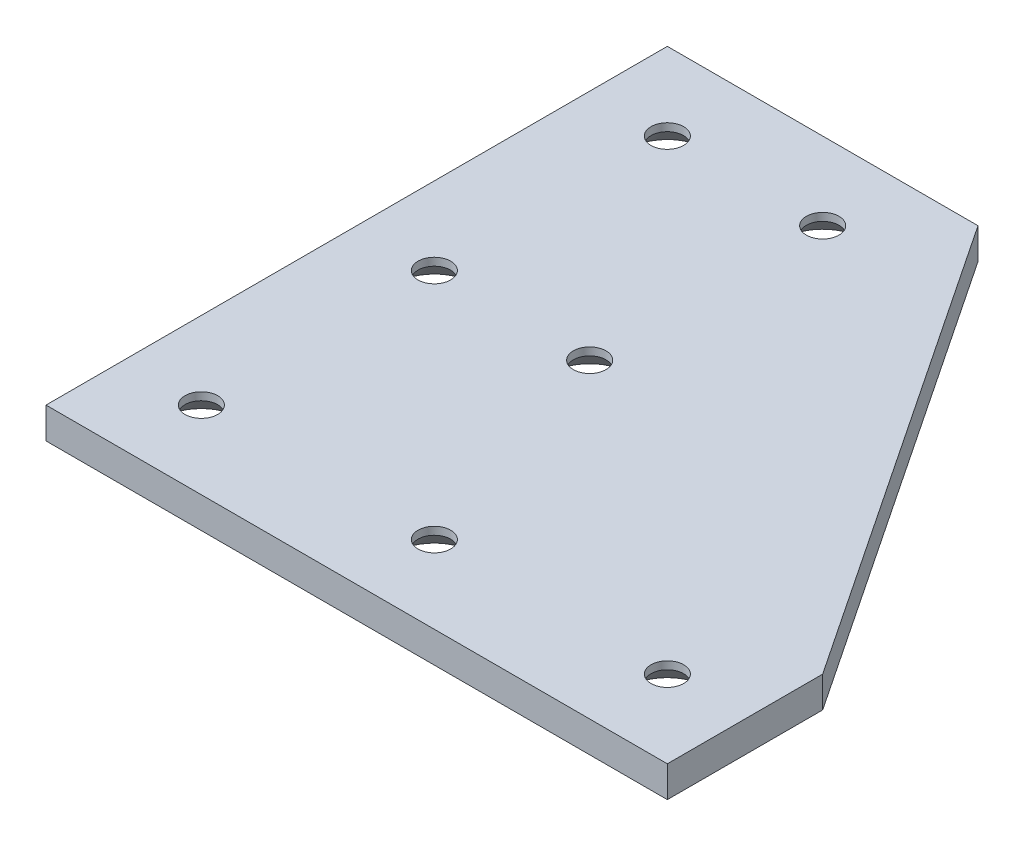
ISO-10303-21;
HEADER;
FILE_DESCRIPTION(('STEP AP214'),'2;1');
FILE_NAME('part.step','',(''),(''),'','','');
FILE_SCHEMA(('AUTOMOTIVE_DESIGN { 1 0 10303 214 1 1 1 1 }'));
ENDSEC;
DATA;
#1=APPLICATION_CONTEXT('core data for automotive mechanical design processes');
#2=APPLICATION_PROTOCOL_DEFINITION('international standard','automotive_design',2000,#1);
#3=PRODUCT_CONTEXT('',#1,'mechanical');
#4=PRODUCT('Part','Part','',(#3));
#5=PRODUCT_RELATED_PRODUCT_CATEGORY('part','',(#4));
#6=PRODUCT_DEFINITION_FORMATION('','',#4);
#7=PRODUCT_DEFINITION_CONTEXT('part definition',#1,'design');
#8=PRODUCT_DEFINITION('design','',#6,#7);
#9=PRODUCT_DEFINITION_SHAPE('','',#8);
#10=(LENGTH_UNIT() NAMED_UNIT(*) SI_UNIT(.MILLI.,.METRE.));
#11=(NAMED_UNIT(*) PLANE_ANGLE_UNIT() SI_UNIT($,.RADIAN.));
#12=(NAMED_UNIT(*) SI_UNIT($,.STERADIAN.) SOLID_ANGLE_UNIT());
#13=UNCERTAINTY_MEASURE_WITH_UNIT(LENGTH_MEASURE(1.E-05),#10,'distance_accuracy_value','');
#14=(GEOMETRIC_REPRESENTATION_CONTEXT(3) GLOBAL_UNCERTAINTY_ASSIGNED_CONTEXT((#13)) GLOBAL_UNIT_ASSIGNED_CONTEXT((#10,
#11,#12)) REPRESENTATION_CONTEXT('',''));
#15=CARTESIAN_POINT('',(0.,0.,0.));
#16=DIRECTION('',(0.,0.,1.));
#17=DIRECTION('',(1.,0.,0.));
#18=AXIS2_PLACEMENT_3D('',#15,#16,#17);
#19=CARTESIAN_POINT('',(0.,4.,-80.));
#20=DIRECTION('',(1.,0.,0.));
#21=DIRECTION('',(0.,0.,-1.));
#22=AXIS2_PLACEMENT_3D('',#19,#20,#21);
#23=PLANE('',#22);
#24=DIRECTION('',(0.,0.,1.));
#25=VECTOR('',#24,1.);
#26=CARTESIAN_POINT('',(0.,0.,-80.));
#27=LINE('',#26,#25);
#28=CARTESIAN_POINT('',(0.,0.,-80.));
#29=VERTEX_POINT('',#28);
#30=CARTESIAN_POINT('',(0.,0.,0.));
#31=VERTEX_POINT('',#30);
#32=EDGE_CURVE('E127',#29,#31,#27,.T.);
#33=ORIENTED_EDGE('',*,*,#32,.T.);
#34=DIRECTION('',(0.,-1.,0.));
#35=VECTOR('',#34,1.);
#36=CARTESIAN_POINT('',(0.,4.,0.));
#37=LINE('',#36,#35);
#38=CARTESIAN_POINT('',(0.,4.,0.));
#39=VERTEX_POINT('',#38);
#40=EDGE_CURVE('E148',#39,#31,#37,.T.);
#41=ORIENTED_EDGE('',*,*,#40,.F.);
#42=DIRECTION('',(0.,0.,1.));
#43=VECTOR('',#42,1.);
#44=CARTESIAN_POINT('',(0.,4.,-80.));
#45=LINE('',#44,#43);
#46=CARTESIAN_POINT('',(0.,4.,-80.));
#47=VERTEX_POINT('',#46);
#48=EDGE_CURVE('E141',#47,#39,#45,.T.);
#49=ORIENTED_EDGE('',*,*,#48,.F.);
#50=DIRECTION('',(0.,-1.,0.));
#51=VECTOR('',#50,1.);
#52=CARTESIAN_POINT('',(0.,4.,-80.));
#53=LINE('',#52,#51);
#54=EDGE_CURVE('E123',#47,#29,#53,.T.);
#55=ORIENTED_EDGE('',*,*,#54,.T.);
#56=EDGE_LOOP('',(#33,#41,#49,#55));
#57=FACE_BOUND('',#56,.T.);
#58=ADVANCED_FACE('F44',(#57),#23,.F.);
#59=CARTESIAN_POINT('',(0.,4.,0.));
#60=DIRECTION('',(0.,0.,-1.));
#61=DIRECTION('',(-1.,0.,0.));
#62=AXIS2_PLACEMENT_3D('',#59,#60,#61);
#63=PLANE('',#62);
#64=DIRECTION('',(1.,0.,0.));
#65=VECTOR('',#64,1.);
#66=CARTESIAN_POINT('',(0.,0.,0.));
#67=LINE('',#66,#65);
#68=CARTESIAN_POINT('',(80.,0.,0.));
#69=VERTEX_POINT('',#68);
#70=EDGE_CURVE('E131',#31,#69,#67,.T.);
#71=ORIENTED_EDGE('',*,*,#70,.T.);
#72=DIRECTION('',(0.,-1.,0.));
#73=VECTOR('',#72,1.);
#74=CARTESIAN_POINT('',(80.,4.,0.));
#75=LINE('',#74,#73);
#76=CARTESIAN_POINT('',(80.,4.,0.));
#77=VERTEX_POINT('',#76);
#78=EDGE_CURVE('E116',#77,#69,#75,.T.);
#79=ORIENTED_EDGE('',*,*,#78,.F.);
#80=DIRECTION('',(1.,0.,0.));
#81=VECTOR('',#80,1.);
#82=CARTESIAN_POINT('',(0.,4.,0.));
#83=LINE('',#82,#81);
#84=EDGE_CURVE('E98',#39,#77,#83,.T.);
#85=ORIENTED_EDGE('',*,*,#84,.F.);
#86=ORIENTED_EDGE('',*,*,#40,.T.);
#87=EDGE_LOOP('',(#71,#79,#85,#86));
#88=FACE_BOUND('',#87,.T.);
#89=ADVANCED_FACE('F234',(#88),#63,.F.);
#90=CARTESIAN_POINT('',(80.,4.,0.));
#91=DIRECTION('',(-1.,0.,0.));
#92=DIRECTION('',(0.,0.,1.));
#93=AXIS2_PLACEMENT_3D('',#90,#91,#92);
#94=PLANE('',#93);
#95=DIRECTION('',(0.,0.,-1.));
#96=VECTOR('',#95,1.);
#97=CARTESIAN_POINT('',(80.,0.,0.));
#98=LINE('',#97,#96);
#99=CARTESIAN_POINT('',(80.,0.,-20.));
#100=VERTEX_POINT('',#99);
#101=EDGE_CURVE('E114',#69,#100,#98,.T.);
#102=ORIENTED_EDGE('',*,*,#101,.T.);
#103=DIRECTION('',(0.,-1.,0.));
#104=VECTOR('',#103,1.);
#105=CARTESIAN_POINT('',(80.,4.,-20.));
#106=LINE('',#105,#104);
#107=CARTESIAN_POINT('',(80.,4.,-20.));
#108=VERTEX_POINT('',#107);
#109=EDGE_CURVE('E111',#108,#100,#106,.T.);
#110=ORIENTED_EDGE('',*,*,#109,.F.);
#111=DIRECTION('',(0.,0.,-1.));
#112=VECTOR('',#111,1.);
#113=CARTESIAN_POINT('',(80.,4.,0.));
#114=LINE('',#113,#112);
#115=EDGE_CURVE('E102',#77,#108,#114,.T.);
#116=ORIENTED_EDGE('',*,*,#115,.F.);
#117=ORIENTED_EDGE('',*,*,#78,.T.);
#118=EDGE_LOOP('',(#102,#110,#116,#117));
#119=FACE_BOUND('',#118,.T.);
#120=ADVANCED_FACE('F112',(#119),#94,.F.);
#121=CARTESIAN_POINT('',(80.,4.,-20.));
#122=DIRECTION('',(-0.832050294337844,0.,0.554700196225229));
#123=DIRECTION('',(0.554700196225229,0.,0.832050294337844));
#124=AXIS2_PLACEMENT_3D('',#121,#122,#123);
#125=PLANE('',#124);
#126=DIRECTION('',(-0.554700196225229,0.,-0.832050294337844));
#127=VECTOR('',#126,1.);
#128=CARTESIAN_POINT('',(80.,0.,-20.));
#129=LINE('',#128,#127);
#130=CARTESIAN_POINT('',(40.,0.,-80.));
#131=VERTEX_POINT('',#130);
#132=EDGE_CURVE('E83',#100,#131,#129,.T.);
#133=ORIENTED_EDGE('',*,*,#132,.T.);
#134=DIRECTION('',(0.,-1.,0.));
#135=VECTOR('',#134,1.);
#136=CARTESIAN_POINT('',(40.,4.,-80.));
#137=LINE('',#136,#135);
#138=CARTESIAN_POINT('',(40.,4.,-80.));
#139=VERTEX_POINT('',#138);
#140=EDGE_CURVE('E117',#139,#131,#137,.T.);
#141=ORIENTED_EDGE('',*,*,#140,.F.);
#142=DIRECTION('',(-0.554700196225229,0.,-0.832050294337844));
#143=VECTOR('',#142,1.);
#144=CARTESIAN_POINT('',(80.,4.,-20.));
#145=LINE('',#144,#143);
#146=EDGE_CURVE('E106',#108,#139,#145,.T.);
#147=ORIENTED_EDGE('',*,*,#146,.F.);
#148=ORIENTED_EDGE('',*,*,#109,.T.);
#149=EDGE_LOOP('',(#133,#141,#147,#148));
#150=FACE_BOUND('',#149,.T.);
#151=ADVANCED_FACE('F119',(#150),#125,.F.);
#152=CARTESIAN_POINT('',(40.,4.,-80.));
#153=DIRECTION('',(0.,0.,1.));
#154=DIRECTION('',(1.,0.,0.));
#155=AXIS2_PLACEMENT_3D('',#152,#153,#154);
#156=PLANE('',#155);
#157=DIRECTION('',(-1.,0.,0.));
#158=VECTOR('',#157,1.);
#159=CARTESIAN_POINT('',(40.,0.,-80.));
#160=LINE('',#159,#158);
#161=EDGE_CURVE('E89',#131,#29,#160,.T.);
#162=ORIENTED_EDGE('',*,*,#161,.T.);
#163=ORIENTED_EDGE('',*,*,#54,.F.);
#164=DIRECTION('',(-1.,0.,0.));
#165=VECTOR('',#164,1.);
#166=CARTESIAN_POINT('',(40.,4.,-80.));
#167=LINE('',#166,#165);
#168=EDGE_CURVE('E63',#139,#47,#167,.T.);
#169=ORIENTED_EDGE('',*,*,#168,.F.);
#170=ORIENTED_EDGE('',*,*,#140,.T.);
#171=EDGE_LOOP('',(#162,#163,#169,#170));
#172=FACE_BOUND('',#171,.T.);
#173=ADVANCED_FACE('F223',(#172),#156,.F.);
#174=CARTESIAN_POINT('',(0.,4.,0.));
#175=DIRECTION('',(0.,1.,0.));
#176=DIRECTION('',(0.,0.,1.));
#177=AXIS2_PLACEMENT_3D('',#174,#175,#176);
#178=PLANE('',#177);
#179=CARTESIAN_POINT('',(9.99999999999979,4.,-70.));
#180=DIRECTION('',(0.,1.,0.));
#181=DIRECTION('',(0.,0.,1.));
#182=AXIS2_PLACEMENT_3D('',#179,#180,#181);
#183=CIRCLE('',#182,2.1);
#184=CARTESIAN_POINT('',(9.99999999999979,4.,-67.9));
#185=VERTEX_POINT('',#184);
#186=EDGE_CURVE('E303',#185,#185,#183,.T.);
#187=ORIENTED_EDGE('',*,*,#186,.F.);
#188=EDGE_LOOP('',(#187));
#189=FACE_BOUND('',#188,.T.);
#190=CARTESIAN_POINT('',(9.9999999999999,4.,-40.));
#191=DIRECTION('',(0.,1.,0.));
#192=DIRECTION('',(0.,0.,1.));
#193=AXIS2_PLACEMENT_3D('',#190,#191,#192);
#194=CIRCLE('',#193,2.1);
#195=CARTESIAN_POINT('',(9.9999999999999,4.,-37.9));
#196=VERTEX_POINT('',#195);
#197=EDGE_CURVE('E309',#196,#196,#194,.T.);
#198=ORIENTED_EDGE('',*,*,#197,.F.);
#199=EDGE_LOOP('',(#198));
#200=FACE_BOUND('',#199,.T.);
#201=CARTESIAN_POINT('',(29.9999999999998,4.,-70.));
#202=DIRECTION('',(0.,1.,0.));
#203=DIRECTION('',(0.,0.,1.));
#204=AXIS2_PLACEMENT_3D('',#201,#202,#203);
#205=CIRCLE('',#204,2.1);
#206=CARTESIAN_POINT('',(29.9999999999998,4.,-67.9));
#207=VERTEX_POINT('',#206);
#208=EDGE_CURVE('E313',#207,#207,#205,.T.);
#209=ORIENTED_EDGE('',*,*,#208,.F.);
#210=EDGE_LOOP('',(#209));
#211=FACE_BOUND('',#210,.T.);
#212=CARTESIAN_POINT('',(29.9999999999999,4.,-40.));
#213=DIRECTION('',(0.,1.,0.));
#214=DIRECTION('',(0.,0.,1.));
#215=AXIS2_PLACEMENT_3D('',#212,#213,#214);
#216=CIRCLE('',#215,2.1);
#217=CARTESIAN_POINT('',(29.9999999999999,4.,-37.9));
#218=VERTEX_POINT('',#217);
#219=EDGE_CURVE('E317',#218,#218,#216,.T.);
#220=ORIENTED_EDGE('',*,*,#219,.F.);
#221=EDGE_LOOP('',(#220));
#222=FACE_BOUND('',#221,.T.);
#223=CARTESIAN_POINT('',(70.,4.,-9.99999999999999));
#224=DIRECTION('',(0.,1.,0.));
#225=DIRECTION('',(0.,0.,1.));
#226=AXIS2_PLACEMENT_3D('',#223,#224,#225);
#227=CIRCLE('',#226,2.1);
#228=CARTESIAN_POINT('',(70.,4.,-7.89999999999999));
#229=VERTEX_POINT('',#228);
#230=EDGE_CURVE('E299',#229,#229,#227,.T.);
#231=ORIENTED_EDGE('',*,*,#230,.F.);
#232=EDGE_LOOP('',(#231));
#233=FACE_BOUND('',#232,.T.);
#234=CARTESIAN_POINT('',(40.,4.,-9.99999999999999));
#235=DIRECTION('',(0.,1.,0.));
#236=DIRECTION('',(0.,0.,1.));
#237=AXIS2_PLACEMENT_3D('',#234,#235,#236);
#238=CIRCLE('',#237,2.1);
#239=CARTESIAN_POINT('',(40.,4.,-7.9));
#240=VERTEX_POINT('',#239);
#241=EDGE_CURVE('E295',#240,#240,#238,.T.);
#242=ORIENTED_EDGE('',*,*,#241,.F.);
#243=EDGE_LOOP('',(#242));
#244=FACE_BOUND('',#243,.T.);
#245=CARTESIAN_POINT('',(10.,4.,-9.99999999999999));
#246=DIRECTION('',(0.,1.,0.));
#247=DIRECTION('',(0.,0.,1.));
#248=AXIS2_PLACEMENT_3D('',#245,#246,#247);
#249=CIRCLE('',#248,2.1);
#250=CARTESIAN_POINT('',(10.,4.,-7.89999999999999));
#251=VERTEX_POINT('',#250);
#252=EDGE_CURVE('E132',#251,#251,#249,.T.);
#253=ORIENTED_EDGE('',*,*,#252,.F.);
#254=EDGE_LOOP('',(#253));
#255=FACE_BOUND('',#254,.T.);
#256=ORIENTED_EDGE('',*,*,#48,.T.);
#257=ORIENTED_EDGE('',*,*,#84,.T.);
#258=ORIENTED_EDGE('',*,*,#115,.T.);
#259=ORIENTED_EDGE('',*,*,#146,.T.);
#260=ORIENTED_EDGE('',*,*,#168,.T.);
#261=EDGE_LOOP('',(#256,#257,#258,#259,#260));
#262=FACE_BOUND('',#261,.T.);
#263=ADVANCED_FACE('F104',(#189,#200,#211,#222,#233,#244,#255,#262),#178,.T.);
#264=CARTESIAN_POINT('',(0.,0.,0.));
#265=DIRECTION('',(0.,1.,0.));
#266=DIRECTION('',(0.,0.,1.));
#267=AXIS2_PLACEMENT_3D('',#264,#265,#266);
#268=PLANE('',#267);
#269=CARTESIAN_POINT('',(9.99999999999979,0.,-70.));
#270=DIRECTION('',(0.,1.,0.));
#271=DIRECTION('',(0.,0.,1.));
#272=AXIS2_PLACEMENT_3D('',#269,#270,#271);
#273=CIRCLE('',#272,5.09999999999998);
#274=CARTESIAN_POINT('',(9.99999999999979,0.,-64.9));
#275=VERTEX_POINT('',#274);
#276=EDGE_CURVE('E175',#275,#275,#273,.T.);
#277=ORIENTED_EDGE('',*,*,#276,.T.);
#278=EDGE_LOOP('',(#277));
#279=FACE_BOUND('',#278,.T.);
#280=CARTESIAN_POINT('',(29.9999999999998,0.,-70.));
#281=DIRECTION('',(0.,1.,0.));
#282=DIRECTION('',(0.,0.,1.));
#283=AXIS2_PLACEMENT_3D('',#280,#281,#282);
#284=CIRCLE('',#283,5.09999999999999);
#285=CARTESIAN_POINT('',(29.9999999999998,0.,-64.9));
#286=VERTEX_POINT('',#285);
#287=EDGE_CURVE('E171',#286,#286,#284,.T.);
#288=ORIENTED_EDGE('',*,*,#287,.T.);
#289=EDGE_LOOP('',(#288));
#290=FACE_BOUND('',#289,.T.);
#291=CARTESIAN_POINT('',(29.9999999999999,0.,-40.));
#292=DIRECTION('',(0.,1.,0.));
#293=DIRECTION('',(0.,0.,1.));
#294=AXIS2_PLACEMENT_3D('',#291,#292,#293);
#295=CIRCLE('',#294,5.09999999999998);
#296=CARTESIAN_POINT('',(29.9999999999999,0.,-34.9));
#297=VERTEX_POINT('',#296);
#298=EDGE_CURVE('E167',#297,#297,#295,.T.);
#299=ORIENTED_EDGE('',*,*,#298,.T.);
#300=EDGE_LOOP('',(#299));
#301=FACE_BOUND('',#300,.T.);
#302=CARTESIAN_POINT('',(9.9999999999999,0.,-40.));
#303=DIRECTION('',(0.,1.,0.));
#304=DIRECTION('',(0.,0.,1.));
#305=AXIS2_PLACEMENT_3D('',#302,#303,#304);
#306=CIRCLE('',#305,5.09999999999998);
#307=CARTESIAN_POINT('',(9.9999999999999,0.,-34.9));
#308=VERTEX_POINT('',#307);
#309=EDGE_CURVE('E163',#308,#308,#306,.T.);
#310=ORIENTED_EDGE('',*,*,#309,.T.);
#311=EDGE_LOOP('',(#310));
#312=FACE_BOUND('',#311,.T.);
#313=CARTESIAN_POINT('',(10.,0.,-9.99999999999999));
#314=DIRECTION('',(0.,1.,0.));
#315=DIRECTION('',(0.,0.,1.));
#316=AXIS2_PLACEMENT_3D('',#313,#314,#315);
#317=CIRCLE('',#316,5.10000000000001);
#318=CARTESIAN_POINT('',(10.,0.,-4.89999999999999));
#319=VERTEX_POINT('',#318);
#320=EDGE_CURVE('E159',#319,#319,#317,.T.);
#321=ORIENTED_EDGE('',*,*,#320,.T.);
#322=EDGE_LOOP('',(#321));
#323=FACE_BOUND('',#322,.T.);
#324=CARTESIAN_POINT('',(40.,0.,-9.99999999999999));
#325=DIRECTION('',(0.,1.,0.));
#326=DIRECTION('',(0.,0.,1.));
#327=AXIS2_PLACEMENT_3D('',#324,#325,#326);
#328=CIRCLE('',#327,5.09999999999999);
#329=CARTESIAN_POINT('',(40.,0.,-4.9));
#330=VERTEX_POINT('',#329);
#331=EDGE_CURVE('E155',#330,#330,#328,.T.);
#332=ORIENTED_EDGE('',*,*,#331,.T.);
#333=EDGE_LOOP('',(#332));
#334=FACE_BOUND('',#333,.T.);
#335=CARTESIAN_POINT('',(70.,0.,-9.99999999999999));
#336=DIRECTION('',(0.,1.,0.));
#337=DIRECTION('',(0.,0.,1.));
#338=AXIS2_PLACEMENT_3D('',#335,#336,#337);
#339=CIRCLE('',#338,5.10000000000001);
#340=CARTESIAN_POINT('',(70.,0.,-4.89999999999999));
#341=VERTEX_POINT('',#340);
#342=EDGE_CURVE('E151',#341,#341,#339,.T.);
#343=ORIENTED_EDGE('',*,*,#342,.T.);
#344=EDGE_LOOP('',(#343));
#345=FACE_BOUND('',#344,.T.);
#346=ORIENTED_EDGE('',*,*,#32,.F.);
#347=ORIENTED_EDGE('',*,*,#161,.F.);
#348=ORIENTED_EDGE('',*,*,#132,.F.);
#349=ORIENTED_EDGE('',*,*,#101,.F.);
#350=ORIENTED_EDGE('',*,*,#70,.F.);
#351=EDGE_LOOP('',(#346,#347,#348,#349,#350));
#352=FACE_BOUND('',#351,.T.);
#353=ADVANCED_FACE('F211',(#279,#290,#301,#312,#323,#334,#345,#352),#268,.F.);
#354=CARTESIAN_POINT('',(10.,0.,-9.99999999999999));
#355=DIRECTION('',(0.,1.,0.));
#356=DIRECTION('',(0.,0.,1.));
#357=AXIS2_PLACEMENT_3D('',#354,#355,#356);
#358=CYLINDRICAL_SURFACE('',#357,2.1);
#359=CARTESIAN_POINT('',(10.,3.00000000000003,-9.99999999999999));
#360=DIRECTION('',(0.,1.,0.));
#361=DIRECTION('',(0.,0.,1.));
#362=AXIS2_PLACEMENT_3D('',#359,#360,#361);
#363=CIRCLE('',#362,2.1);
#364=CARTESIAN_POINT('',(10.,3.00000000000003,-7.89999999999999));
#365=VERTEX_POINT('',#364);
#366=EDGE_CURVE('E195',#365,#365,#363,.F.);
#367=ORIENTED_EDGE('',*,*,#366,.T.);
#368=EDGE_LOOP('',(#367));
#369=FACE_BOUND('',#368,.T.);
#370=ORIENTED_EDGE('',*,*,#252,.T.);
#371=EDGE_LOOP('',(#370));
#372=FACE_BOUND('',#371,.T.);
#373=ADVANCED_FACE('F214',(#369,#372),#358,.F.);
#374=CARTESIAN_POINT('',(40.,0.,-9.99999999999999));
#375=DIRECTION('',(0.,1.,0.));
#376=DIRECTION('',(0.,0.,1.));
#377=AXIS2_PLACEMENT_3D('',#374,#375,#376);
#378=CYLINDRICAL_SURFACE('',#377,2.1);
#379=CARTESIAN_POINT('',(40.,3.00000000000002,-9.99999999999999));
#380=DIRECTION('',(0.,1.,0.));
#381=DIRECTION('',(0.,0.,1.));
#382=AXIS2_PLACEMENT_3D('',#379,#380,#381);
#383=CIRCLE('',#382,2.1);
#384=CARTESIAN_POINT('',(40.,3.00000000000002,-7.9));
#385=VERTEX_POINT('',#384);
#386=EDGE_CURVE('E55',#385,#385,#383,.F.);
#387=ORIENTED_EDGE('',*,*,#386,.T.);
#388=EDGE_LOOP('',(#387));
#389=FACE_BOUND('',#388,.T.);
#390=ORIENTED_EDGE('',*,*,#241,.T.);
#391=EDGE_LOOP('',(#390));
#392=FACE_BOUND('',#391,.T.);
#393=ADVANCED_FACE('F202',(#389,#392),#378,.F.);
#394=CARTESIAN_POINT('',(70.,0.,-9.99999999999999));
#395=DIRECTION('',(0.,1.,0.));
#396=DIRECTION('',(0.,0.,1.));
#397=AXIS2_PLACEMENT_3D('',#394,#395,#396);
#398=CYLINDRICAL_SURFACE('',#397,2.1);
#399=CARTESIAN_POINT('',(70.,3.00000000000002,-9.99999999999999));
#400=DIRECTION('',(0.,1.,0.));
#401=DIRECTION('',(0.,0.,1.));
#402=AXIS2_PLACEMENT_3D('',#399,#400,#401);
#403=CIRCLE('',#402,2.1);
#404=CARTESIAN_POINT('',(70.,3.00000000000002,-7.89999999999999));
#405=VERTEX_POINT('',#404);
#406=EDGE_CURVE('E11',#405,#405,#403,.F.);
#407=ORIENTED_EDGE('',*,*,#406,.T.);
#408=EDGE_LOOP('',(#407));
#409=FACE_BOUND('',#408,.T.);
#410=ORIENTED_EDGE('',*,*,#230,.T.);
#411=EDGE_LOOP('',(#410));
#412=FACE_BOUND('',#411,.T.);
#413=ADVANCED_FACE('F325',(#409,#412),#398,.F.);
#414=CARTESIAN_POINT('',(29.9999999999999,0.,-40.));
#415=DIRECTION('',(0.,1.,0.));
#416=DIRECTION('',(0.,0.,1.));
#417=AXIS2_PLACEMENT_3D('',#414,#415,#416);
#418=CYLINDRICAL_SURFACE('',#417,2.1);
#419=CARTESIAN_POINT('',(29.9999999999999,2.99999999999999,-40.));
#420=DIRECTION('',(0.,1.,0.));
#421=DIRECTION('',(0.,0.,1.));
#422=AXIS2_PLACEMENT_3D('',#419,#420,#421);
#423=CIRCLE('',#422,2.1);
#424=CARTESIAN_POINT('',(29.9999999999999,2.99999999999999,-37.9));
#425=VERTEX_POINT('',#424);
#426=EDGE_CURVE('E187',#425,#425,#423,.F.);
#427=ORIENTED_EDGE('',*,*,#426,.T.);
#428=EDGE_LOOP('',(#427));
#429=FACE_BOUND('',#428,.T.);
#430=ORIENTED_EDGE('',*,*,#219,.T.);
#431=EDGE_LOOP('',(#430));
#432=FACE_BOUND('',#431,.T.);
#433=ADVANCED_FACE('F334',(#429,#432),#418,.F.);
#434=CARTESIAN_POINT('',(29.9999999999998,0.,-70.));
#435=DIRECTION('',(0.,1.,0.));
#436=DIRECTION('',(0.,0.,1.));
#437=AXIS2_PLACEMENT_3D('',#434,#435,#436);
#438=CYLINDRICAL_SURFACE('',#437,2.1);
#439=CARTESIAN_POINT('',(29.9999999999998,3.00000000000001,-70.));
#440=DIRECTION('',(0.,1.,0.));
#441=DIRECTION('',(0.,0.,1.));
#442=AXIS2_PLACEMENT_3D('',#439,#440,#441);
#443=CIRCLE('',#442,2.1);
#444=CARTESIAN_POINT('',(29.9999999999998,3.00000000000001,-67.9));
#445=VERTEX_POINT('',#444);
#446=EDGE_CURVE('E183',#445,#445,#443,.F.);
#447=ORIENTED_EDGE('',*,*,#446,.T.);
#448=EDGE_LOOP('',(#447));
#449=FACE_BOUND('',#448,.T.);
#450=ORIENTED_EDGE('',*,*,#208,.T.);
#451=EDGE_LOOP('',(#450));
#452=FACE_BOUND('',#451,.T.);
#453=ADVANCED_FACE('F340',(#449,#452),#438,.F.);
#454=CARTESIAN_POINT('',(9.9999999999999,0.,-40.));
#455=DIRECTION('',(0.,1.,0.));
#456=DIRECTION('',(0.,0.,1.));
#457=AXIS2_PLACEMENT_3D('',#454,#455,#456);
#458=CYLINDRICAL_SURFACE('',#457,2.1);
#459=CARTESIAN_POINT('',(9.9999999999999,2.99999999999999,-40.));
#460=DIRECTION('',(0.,1.,0.));
#461=DIRECTION('',(0.,0.,1.));
#462=AXIS2_PLACEMENT_3D('',#459,#460,#461);
#463=CIRCLE('',#462,2.1);
#464=CARTESIAN_POINT('',(9.9999999999999,2.99999999999999,-37.9));
#465=VERTEX_POINT('',#464);
#466=EDGE_CURVE('E191',#465,#465,#463,.F.);
#467=ORIENTED_EDGE('',*,*,#466,.T.);
#468=EDGE_LOOP('',(#467));
#469=FACE_BOUND('',#468,.T.);
#470=ORIENTED_EDGE('',*,*,#197,.T.);
#471=EDGE_LOOP('',(#470));
#472=FACE_BOUND('',#471,.T.);
#473=ADVANCED_FACE('F344',(#469,#472),#458,.F.);
#474=CARTESIAN_POINT('',(9.99999999999979,0.,-70.));
#475=DIRECTION('',(0.,1.,0.));
#476=DIRECTION('',(0.,0.,1.));
#477=AXIS2_PLACEMENT_3D('',#474,#475,#476);
#478=CYLINDRICAL_SURFACE('',#477,2.1);
#479=CARTESIAN_POINT('',(9.99999999999979,2.99999999999999,-70.));
#480=DIRECTION('',(0.,1.,0.));
#481=DIRECTION('',(0.,0.,1.));
#482=AXIS2_PLACEMENT_3D('',#479,#480,#481);
#483=CIRCLE('',#482,2.1);
#484=CARTESIAN_POINT('',(9.99999999999979,2.99999999999999,-67.9));
#485=VERTEX_POINT('',#484);
#486=EDGE_CURVE('E179',#485,#485,#483,.F.);
#487=ORIENTED_EDGE('',*,*,#486,.T.);
#488=EDGE_LOOP('',(#487));
#489=FACE_BOUND('',#488,.T.);
#490=ORIENTED_EDGE('',*,*,#186,.T.);
#491=EDGE_LOOP('',(#490));
#492=FACE_BOUND('',#491,.T.);
#493=ADVANCED_FACE('F250',(#489,#492),#478,.F.);
#494=CARTESIAN_POINT('',(9.99999999999979,0.,-70.));
#495=DIRECTION('',(0.,-1.,0.));
#496=DIRECTION('',(0.,0.,-1.));
#497=AXIS2_PLACEMENT_3D('',#494,#495,#496);
#498=CONICAL_SURFACE('',#497,5.09999999999998,0.785398163397446);
#499=ORIENTED_EDGE('',*,*,#486,.F.);
#500=EDGE_LOOP('',(#499));
#501=FACE_BOUND('',#500,.T.);
#502=ORIENTED_EDGE('',*,*,#276,.F.);
#503=EDGE_LOOP('',(#502));
#504=FACE_BOUND('',#503,.T.);
#505=ADVANCED_FACE('F243',(#501,#504),#498,.F.);
#506=CARTESIAN_POINT('',(29.9999999999998,0.,-70.));
#507=DIRECTION('',(0.,-1.,0.));
#508=DIRECTION('',(0.,0.,-1.));
#509=AXIS2_PLACEMENT_3D('',#506,#507,#508);
#510=CONICAL_SURFACE('',#509,5.09999999999999,0.785398163397446);
#511=ORIENTED_EDGE('',*,*,#446,.F.);
#512=EDGE_LOOP('',(#511));
#513=FACE_BOUND('',#512,.T.);
#514=ORIENTED_EDGE('',*,*,#287,.F.);
#515=EDGE_LOOP('',(#514));
#516=FACE_BOUND('',#515,.T.);
#517=ADVANCED_FACE('F249',(#513,#516),#510,.F.);
#518=CARTESIAN_POINT('',(29.9999999999999,0.,-40.));
#519=DIRECTION('',(0.,-1.,0.));
#520=DIRECTION('',(0.,0.,-1.));
#521=AXIS2_PLACEMENT_3D('',#518,#519,#520);
#522=CONICAL_SURFACE('',#521,5.09999999999998,0.785398163397446);
#523=ORIENTED_EDGE('',*,*,#426,.F.);
#524=EDGE_LOOP('',(#523));
#525=FACE_BOUND('',#524,.T.);
#526=ORIENTED_EDGE('',*,*,#298,.F.);
#527=EDGE_LOOP('',(#526));
#528=FACE_BOUND('',#527,.T.);
#529=ADVANCED_FACE('F257',(#525,#528),#522,.F.);
#530=CARTESIAN_POINT('',(9.9999999999999,0.,-40.));
#531=DIRECTION('',(0.,-1.,0.));
#532=DIRECTION('',(0.,0.,-1.));
#533=AXIS2_PLACEMENT_3D('',#530,#531,#532);
#534=CONICAL_SURFACE('',#533,5.09999999999998,0.785398163397446);
#535=ORIENTED_EDGE('',*,*,#466,.F.);
#536=EDGE_LOOP('',(#535));
#537=FACE_BOUND('',#536,.T.);
#538=ORIENTED_EDGE('',*,*,#309,.F.);
#539=EDGE_LOOP('',(#538));
#540=FACE_BOUND('',#539,.T.);
#541=ADVANCED_FACE('F264',(#537,#540),#534,.F.);
#542=CARTESIAN_POINT('',(10.,0.,-9.99999999999999));
#543=DIRECTION('',(0.,-1.,0.));
#544=DIRECTION('',(0.,0.,-1.));
#545=AXIS2_PLACEMENT_3D('',#542,#543,#544);
#546=CONICAL_SURFACE('',#545,5.10000000000001,0.785398163397445);
#547=ORIENTED_EDGE('',*,*,#366,.F.);
#548=EDGE_LOOP('',(#547));
#549=FACE_BOUND('',#548,.T.);
#550=ORIENTED_EDGE('',*,*,#320,.F.);
#551=EDGE_LOOP('',(#550));
#552=FACE_BOUND('',#551,.T.);
#553=ADVANCED_FACE('F208',(#549,#552),#546,.F.);
#554=CARTESIAN_POINT('',(40.,0.,-9.99999999999999));
#555=DIRECTION('',(0.,-1.,0.));
#556=DIRECTION('',(0.,0.,-1.));
#557=AXIS2_PLACEMENT_3D('',#554,#555,#556);
#558=CONICAL_SURFACE('',#557,5.09999999999999,0.785398163397445);
#559=ORIENTED_EDGE('',*,*,#386,.F.);
#560=EDGE_LOOP('',(#559));
#561=FACE_BOUND('',#560,.T.);
#562=ORIENTED_EDGE('',*,*,#331,.F.);
#563=EDGE_LOOP('',(#562));
#564=FACE_BOUND('',#563,.T.);
#565=ADVANCED_FACE('F205',(#561,#564),#558,.F.);
#566=CARTESIAN_POINT('',(70.,0.,-9.99999999999999));
#567=DIRECTION('',(0.,-1.,0.));
#568=DIRECTION('',(0.,0.,-1.));
#569=AXIS2_PLACEMENT_3D('',#566,#567,#568);
#570=CONICAL_SURFACE('',#569,5.10000000000001,0.785398163397445);
#571=ORIENTED_EDGE('',*,*,#406,.F.);
#572=EDGE_LOOP('',(#571));
#573=FACE_BOUND('',#572,.T.);
#574=ORIENTED_EDGE('',*,*,#342,.F.);
#575=EDGE_LOOP('',(#574));
#576=FACE_BOUND('',#575,.T.);
#577=ADVANCED_FACE('F47',(#573,#576),#570,.F.);
#578=CLOSED_SHELL('',(#58,#89,#120,#151,#173,#263,#353,#373,#393,#413,#433,#453,#473,#493,#505,
#517,#529,#541,#553,#565,#577));
#579=MANIFOLD_SOLID_BREP('B2',#578);
#580=ADVANCED_BREP_SHAPE_REPRESENTATION('',(#18,#579),#14);
#581=SHAPE_DEFINITION_REPRESENTATION(#9,#580);
ENDSEC;
END-ISO-10303-21;
